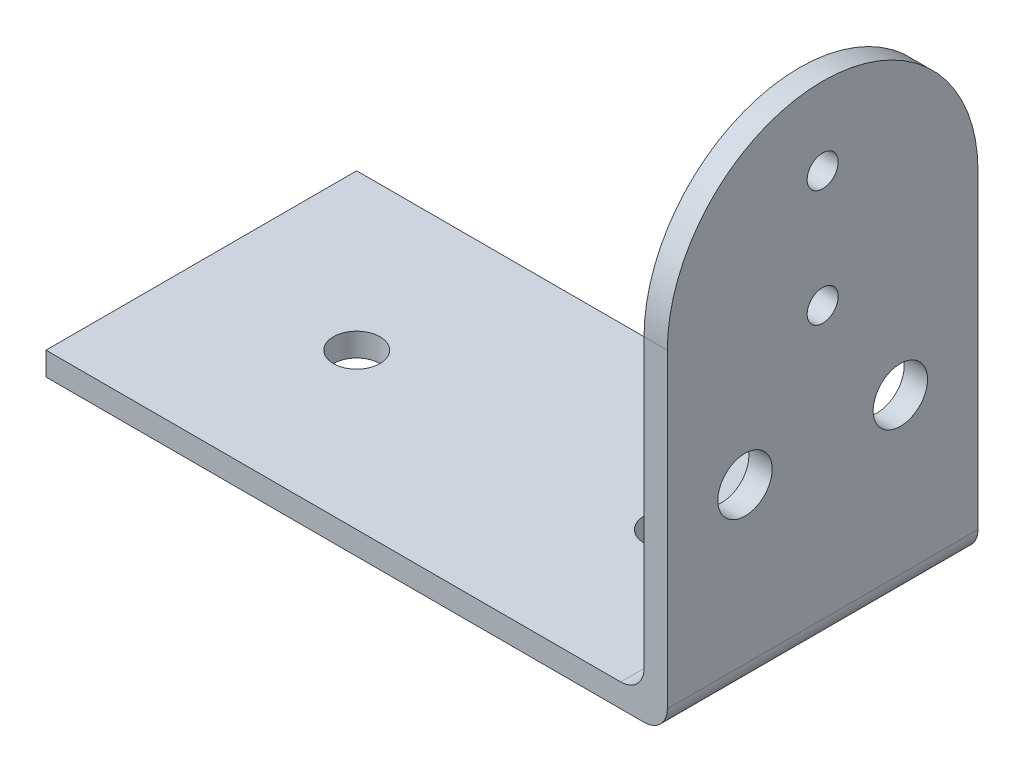
ISO-10303-21;
HEADER;
FILE_DESCRIPTION(('STEP AP214'),'2;1');
FILE_NAME('part.step','',(''),(''),'','','');
FILE_SCHEMA(('AUTOMOTIVE_DESIGN { 1 0 10303 214 1 1 1 1 }'));
ENDSEC;
DATA;
#1=APPLICATION_CONTEXT('core data for automotive mechanical design processes');
#2=APPLICATION_PROTOCOL_DEFINITION('international standard','automotive_design',2000,#1);
#3=PRODUCT_CONTEXT('',#1,'mechanical');
#4=PRODUCT('Part','Part','',(#3));
#5=PRODUCT_RELATED_PRODUCT_CATEGORY('part','',(#4));
#6=PRODUCT_DEFINITION_FORMATION('','',#4);
#7=PRODUCT_DEFINITION_CONTEXT('part definition',#1,'design');
#8=PRODUCT_DEFINITION('design','',#6,#7);
#9=PRODUCT_DEFINITION_SHAPE('','',#8);
#10=(LENGTH_UNIT() NAMED_UNIT(*) SI_UNIT(.MILLI.,.METRE.));
#11=(NAMED_UNIT(*) PLANE_ANGLE_UNIT() SI_UNIT($,.RADIAN.));
#12=(NAMED_UNIT(*) SI_UNIT($,.STERADIAN.) SOLID_ANGLE_UNIT());
#13=UNCERTAINTY_MEASURE_WITH_UNIT(LENGTH_MEASURE(1.E-05),#10,'distance_accuracy_value','');
#14=(GEOMETRIC_REPRESENTATION_CONTEXT(3) GLOBAL_UNCERTAINTY_ASSIGNED_CONTEXT((#13)) GLOBAL_UNIT_ASSIGNED_CONTEXT((#10,
#11,#12)) REPRESENTATION_CONTEXT('',''));
#15=CARTESIAN_POINT('',(0.,0.,0.));
#16=DIRECTION('',(0.,0.,1.));
#17=DIRECTION('',(1.,0.,0.));
#18=AXIS2_PLACEMENT_3D('',#15,#16,#17);
#19=CARTESIAN_POINT('',(80.,-3.,0.));
#20=DIRECTION('',(1.,0.,0.));
#21=DIRECTION('',(0.,0.,-1.));
#22=AXIS2_PLACEMENT_3D('',#19,#20,#21);
#23=PLANE('',#22);
#24=CARTESIAN_POINT('',(80.,50.,-20.));
#25=DIRECTION('',(1.,0.,0.));
#26=DIRECTION('',(0.,0.,-1.));
#27=AXIS2_PLACEMENT_3D('',#24,#25,#26);
#28=CIRCLE('',#27,2.);
#29=CARTESIAN_POINT('',(80.,50.,-22.));
#30=VERTEX_POINT('',#29);
#31=EDGE_CURVE('E241',#30,#30,#28,.T.);
#32=ORIENTED_EDGE('',*,*,#31,.F.);
#33=EDGE_LOOP('',(#32));
#34=FACE_BOUND('',#33,.T.);
#35=CARTESIAN_POINT('',(80.,35.,-20.));
#36=DIRECTION('',(1.,0.,0.));
#37=DIRECTION('',(0.,0.,-1.));
#38=AXIS2_PLACEMENT_3D('',#35,#36,#37);
#39=CIRCLE('',#38,2.);
#40=CARTESIAN_POINT('',(80.,35.,-22.));
#41=VERTEX_POINT('',#40);
#42=EDGE_CURVE('E238',#41,#41,#39,.T.);
#43=ORIENTED_EDGE('',*,*,#42,.F.);
#44=EDGE_LOOP('',(#43));
#45=FACE_BOUND('',#44,.T.);
#46=CARTESIAN_POINT('',(80.,20.,-9.99999999999999));
#47=DIRECTION('',(1.,0.,0.));
#48=DIRECTION('',(0.,0.,-1.));
#49=AXIS2_PLACEMENT_3D('',#46,#47,#48);
#50=CIRCLE('',#49,3.5);
#51=CARTESIAN_POINT('',(80.,20.,-13.5));
#52=VERTEX_POINT('',#51);
#53=EDGE_CURVE('E237',#52,#52,#50,.T.);
#54=ORIENTED_EDGE('',*,*,#53,.F.);
#55=EDGE_LOOP('',(#54));
#56=FACE_BOUND('',#55,.T.);
#57=CARTESIAN_POINT('',(80.,20.,-30.));
#58=DIRECTION('',(1.,0.,0.));
#59=DIRECTION('',(0.,0.,-1.));
#60=AXIS2_PLACEMENT_3D('',#57,#58,#59);
#61=CIRCLE('',#60,3.5);
#62=CARTESIAN_POINT('',(80.,20.,-33.5));
#63=VERTEX_POINT('',#62);
#64=EDGE_CURVE('E233',#63,#63,#61,.F.);
#65=ORIENTED_EDGE('',*,*,#64,.T.);
#66=EDGE_LOOP('',(#65));
#67=FACE_BOUND('',#66,.T.);
#68=DIRECTION('',(0.,1.,0.));
#69=VECTOR('',#68,1.);
#70=CARTESIAN_POINT('',(80.,-3.,-40.));
#71=LINE('',#70,#69);
#72=CARTESIAN_POINT('',(80.,0.,-40.));
#73=VERTEX_POINT('',#72);
#74=CARTESIAN_POINT('',(80.,40.,-40.));
#75=VERTEX_POINT('',#74);
#76=EDGE_CURVE('E155',#73,#75,#71,.T.);
#77=ORIENTED_EDGE('',*,*,#76,.T.);
#78=CARTESIAN_POINT('',(80.,40.,-20.));
#79=DIRECTION('',(1.,0.,0.));
#80=DIRECTION('',(0.,0.,-1.));
#81=AXIS2_PLACEMENT_3D('',#78,#79,#80);
#82=CIRCLE('',#81,20.);
#83=CARTESIAN_POINT('',(80.,40.,0.));
#84=VERTEX_POINT('',#83);
#85=EDGE_CURVE('E142',#75,#84,#82,.T.);
#86=ORIENTED_EDGE('',*,*,#85,.T.);
#87=DIRECTION('',(0.,1.,0.));
#88=VECTOR('',#87,1.);
#89=CARTESIAN_POINT('',(80.,-3.,0.));
#90=LINE('',#89,#88);
#91=CARTESIAN_POINT('',(80.,0.,0.));
#92=VERTEX_POINT('',#91);
#93=EDGE_CURVE('E163',#92,#84,#90,.T.);
#94=ORIENTED_EDGE('',*,*,#93,.F.);
#95=DIRECTION('',(0.,0.,-1.));
#96=VECTOR('',#95,1.);
#97=CARTESIAN_POINT('',(80.,0.,-40.));
#98=LINE('',#97,#96);
#99=EDGE_CURVE('E160',#92,#73,#98,.T.);
#100=ORIENTED_EDGE('',*,*,#99,.T.);
#101=EDGE_LOOP('',(#77,#86,#94,#100));
#102=FACE_BOUND('',#101,.T.);
#103=ADVANCED_FACE('F74',(#34,#45,#56,#67,#102),#23,.T.);
#104=CARTESIAN_POINT('',(77.,60.,0.));
#105=DIRECTION('',(1.,0.,0.));
#106=DIRECTION('',(0.,0.,-1.));
#107=AXIS2_PLACEMENT_3D('',#104,#105,#106);
#108=PLANE('',#107);
#109=CARTESIAN_POINT('',(77.,35.,-20.));
#110=DIRECTION('',(1.,0.,0.));
#111=DIRECTION('',(0.,0.,-1.));
#112=AXIS2_PLACEMENT_3D('',#109,#110,#111);
#113=CIRCLE('',#112,2.);
#114=CARTESIAN_POINT('',(77.,35.,-22.));
#115=VERTEX_POINT('',#114);
#116=EDGE_CURVE('E206',#115,#115,#113,.T.);
#117=ORIENTED_EDGE('',*,*,#116,.T.);
#118=EDGE_LOOP('',(#117));
#119=FACE_BOUND('',#118,.T.);
#120=CARTESIAN_POINT('',(77.,20.,-9.99999999999999));
#121=DIRECTION('',(1.,0.,0.));
#122=DIRECTION('',(0.,0.,-1.));
#123=AXIS2_PLACEMENT_3D('',#120,#121,#122);
#124=CIRCLE('',#123,3.5);
#125=CARTESIAN_POINT('',(77.,20.,-13.5));
#126=VERTEX_POINT('',#125);
#127=EDGE_CURVE('E197',#126,#126,#124,.T.);
#128=ORIENTED_EDGE('',*,*,#127,.T.);
#129=EDGE_LOOP('',(#128));
#130=FACE_BOUND('',#129,.T.);
#131=CARTESIAN_POINT('',(77.,20.,-30.));
#132=DIRECTION('',(1.,0.,0.));
#133=DIRECTION('',(0.,0.,-1.));
#134=AXIS2_PLACEMENT_3D('',#131,#132,#133);
#135=CIRCLE('',#134,3.5);
#136=CARTESIAN_POINT('',(77.,20.,-33.5));
#137=VERTEX_POINT('',#136);
#138=EDGE_CURVE('E201',#137,#137,#135,.F.);
#139=ORIENTED_EDGE('',*,*,#138,.F.);
#140=EDGE_LOOP('',(#139));
#141=FACE_BOUND('',#140,.T.);
#142=CARTESIAN_POINT('',(77.,50.,-20.));
#143=DIRECTION('',(1.,0.,0.));
#144=DIRECTION('',(0.,0.,-1.));
#145=AXIS2_PLACEMENT_3D('',#142,#143,#144);
#146=CIRCLE('',#145,2.);
#147=CARTESIAN_POINT('',(77.,50.,-22.));
#148=VERTEX_POINT('',#147);
#149=EDGE_CURVE('E210',#148,#148,#146,.T.);
#150=ORIENTED_EDGE('',*,*,#149,.T.);
#151=EDGE_LOOP('',(#150));
#152=FACE_BOUND('',#151,.T.);
#153=CARTESIAN_POINT('',(77.,40.,-20.));
#154=DIRECTION('',(1.,0.,0.));
#155=DIRECTION('',(0.,0.,-1.));
#156=AXIS2_PLACEMENT_3D('',#153,#154,#155);
#157=CIRCLE('',#156,20.);
#158=CARTESIAN_POINT('',(77.,40.,-40.));
#159=VERTEX_POINT('',#158);
#160=CARTESIAN_POINT('',(77.,40.,0.));
#161=VERTEX_POINT('',#160);
#162=EDGE_CURVE('E202',#159,#161,#157,.T.);
#163=ORIENTED_EDGE('',*,*,#162,.F.);
#164=DIRECTION('',(0.,-1.,0.));
#165=VECTOR('',#164,1.);
#166=CARTESIAN_POINT('',(77.,60.,-40.));
#167=LINE('',#166,#165);
#168=CARTESIAN_POINT('',(77.,3.,-40.));
#169=VERTEX_POINT('',#168);
#170=EDGE_CURVE('E157',#159,#169,#167,.T.);
#171=ORIENTED_EDGE('',*,*,#170,.T.);
#172=DIRECTION('',(0.,0.,1.));
#173=VECTOR('',#172,1.);
#174=CARTESIAN_POINT('',(77.,3.,0.));
#175=LINE('',#174,#173);
#176=CARTESIAN_POINT('',(77.,3.,0.));
#177=VERTEX_POINT('',#176);
#178=EDGE_CURVE('E186',#169,#177,#175,.T.);
#179=ORIENTED_EDGE('',*,*,#178,.T.);
#180=DIRECTION('',(0.,-1.,0.));
#181=VECTOR('',#180,1.);
#182=CARTESIAN_POINT('',(77.,60.,0.));
#183=LINE('',#182,#181);
#184=EDGE_CURVE('E92',#161,#177,#183,.T.);
#185=ORIENTED_EDGE('',*,*,#184,.F.);
#186=EDGE_LOOP('',(#163,#171,#179,#185));
#187=FACE_BOUND('',#186,.T.);
#188=ADVANCED_FACE('F290',(#119,#130,#141,#152,#187),#108,.F.);
#189=CARTESIAN_POINT('',(0.,-3.,0.));
#190=DIRECTION('',(0.,0.,1.));
#191=DIRECTION('',(1.,0.,0.));
#192=AXIS2_PLACEMENT_3D('',#189,#190,#191);
#193=PLANE('',#192);
#194=DIRECTION('',(1.,0.,0.));
#195=VECTOR('',#194,1.);
#196=CARTESIAN_POINT('',(0.,40.,0.));
#197=LINE('',#196,#195);
#198=EDGE_CURVE('E145',#161,#84,#197,.T.);
#199=ORIENTED_EDGE('',*,*,#198,.F.);
#200=ORIENTED_EDGE('',*,*,#184,.T.);
#201=CARTESIAN_POINT('',(74.,3.,0.));
#202=DIRECTION('',(0.,0.,1.));
#203=DIRECTION('',(1.,0.,0.));
#204=AXIS2_PLACEMENT_3D('',#201,#202,#203);
#205=CIRCLE('',#204,3.);
#206=CARTESIAN_POINT('',(74.,0.,0.));
#207=VERTEX_POINT('',#206);
#208=EDGE_CURVE('E96',#177,#207,#205,.F.);
#209=ORIENTED_EDGE('',*,*,#208,.T.);
#210=DIRECTION('',(1.,0.,0.));
#211=VECTOR('',#210,1.);
#212=CARTESIAN_POINT('',(0.,0.,0.));
#213=LINE('',#212,#211);
#214=CARTESIAN_POINT('',(0.,0.,0.));
#215=VERTEX_POINT('',#214);
#216=EDGE_CURVE('E257',#215,#207,#213,.T.);
#217=ORIENTED_EDGE('',*,*,#216,.F.);
#218=DIRECTION('',(0.,1.,0.));
#219=VECTOR('',#218,1.);
#220=CARTESIAN_POINT('',(0.,-3.,0.));
#221=LINE('',#220,#219);
#222=CARTESIAN_POINT('',(0.,-3.,0.));
#223=VERTEX_POINT('',#222);
#224=EDGE_CURVE('E169',#223,#215,#221,.T.);
#225=ORIENTED_EDGE('',*,*,#224,.F.);
#226=DIRECTION('',(1.,0.,0.));
#227=VECTOR('',#226,1.);
#228=CARTESIAN_POINT('',(0.,-3.,0.));
#229=LINE('',#228,#227);
#230=CARTESIAN_POINT('',(77.,-3.,0.));
#231=VERTEX_POINT('',#230);
#232=EDGE_CURVE('E258',#223,#231,#229,.T.);
#233=ORIENTED_EDGE('',*,*,#232,.T.);
#234=CARTESIAN_POINT('',(77.,0.,0.));
#235=DIRECTION('',(0.,0.,1.));
#236=DIRECTION('',(1.,0.,0.));
#237=AXIS2_PLACEMENT_3D('',#234,#235,#236);
#238=CIRCLE('',#237,3.);
#239=EDGE_CURVE('E183',#231,#92,#238,.T.);
#240=ORIENTED_EDGE('',*,*,#239,.T.);
#241=ORIENTED_EDGE('',*,*,#93,.T.);
#242=EDGE_LOOP('',(#199,#200,#209,#217,#225,#233,#240,#241));
#243=FACE_BOUND('',#242,.T.);
#244=ADVANCED_FACE('F288',(#243),#193,.T.);
#245=CARTESIAN_POINT('',(0.,-3.,0.));
#246=DIRECTION('',(1.,0.,0.));
#247=DIRECTION('',(0.,0.,-1.));
#248=AXIS2_PLACEMENT_3D('',#245,#246,#247);
#249=PLANE('',#248);
#250=DIRECTION('',(0.,0.,-1.));
#251=VECTOR('',#250,1.);
#252=CARTESIAN_POINT('',(0.,0.,0.));
#253=LINE('',#252,#251);
#254=CARTESIAN_POINT('',(0.,0.,-40.));
#255=VERTEX_POINT('',#254);
#256=EDGE_CURVE('E263',#215,#255,#253,.T.);
#257=ORIENTED_EDGE('',*,*,#256,.T.);
#258=DIRECTION('',(0.,1.,0.));
#259=VECTOR('',#258,1.);
#260=CARTESIAN_POINT('',(0.,-3.,-40.));
#261=LINE('',#260,#259);
#262=CARTESIAN_POINT('',(0.,-3.,-40.));
#263=VERTEX_POINT('',#262);
#264=EDGE_CURVE('E162',#263,#255,#261,.T.);
#265=ORIENTED_EDGE('',*,*,#264,.F.);
#266=DIRECTION('',(0.,0.,-1.));
#267=VECTOR('',#266,1.);
#268=CARTESIAN_POINT('',(0.,-3.,0.));
#269=LINE('',#268,#267);
#270=EDGE_CURVE('E171',#223,#263,#269,.T.);
#271=ORIENTED_EDGE('',*,*,#270,.F.);
#272=ORIENTED_EDGE('',*,*,#224,.T.);
#273=EDGE_LOOP('',(#257,#265,#271,#272));
#274=FACE_BOUND('',#273,.T.);
#275=ADVANCED_FACE('F281',(#274),#249,.F.);
#276=CARTESIAN_POINT('',(0.,-3.,-40.));
#277=DIRECTION('',(0.,0.,1.));
#278=DIRECTION('',(1.,0.,0.));
#279=AXIS2_PLACEMENT_3D('',#276,#277,#278);
#280=PLANE('',#279);
#281=ORIENTED_EDGE('',*,*,#170,.F.);
#282=DIRECTION('',(1.,0.,0.));
#283=VECTOR('',#282,1.);
#284=CARTESIAN_POINT('',(0.,40.,-40.));
#285=LINE('',#284,#283);
#286=EDGE_CURVE('E12',#159,#75,#285,.T.);
#287=ORIENTED_EDGE('',*,*,#286,.T.);
#288=ORIENTED_EDGE('',*,*,#76,.F.);
#289=CARTESIAN_POINT('',(77.,0.,-40.));
#290=DIRECTION('',(0.,0.,1.));
#291=DIRECTION('',(1.,0.,0.));
#292=AXIS2_PLACEMENT_3D('',#289,#290,#291);
#293=CIRCLE('',#292,3.);
#294=CARTESIAN_POINT('',(77.,-3.,-40.));
#295=VERTEX_POINT('',#294);
#296=EDGE_CURVE('E177',#73,#295,#293,.F.);
#297=ORIENTED_EDGE('',*,*,#296,.T.);
#298=DIRECTION('',(1.,0.,0.));
#299=VECTOR('',#298,1.);
#300=CARTESIAN_POINT('',(0.,-3.,-40.));
#301=LINE('',#300,#299);
#302=EDGE_CURVE('E262',#263,#295,#301,.T.);
#303=ORIENTED_EDGE('',*,*,#302,.F.);
#304=ORIENTED_EDGE('',*,*,#264,.T.);
#305=DIRECTION('',(1.,0.,0.));
#306=VECTOR('',#305,1.);
#307=CARTESIAN_POINT('',(0.,0.,-40.));
#308=LINE('',#307,#306);
#309=CARTESIAN_POINT('',(74.,0.,-40.));
#310=VERTEX_POINT('',#309);
#311=EDGE_CURVE('E271',#255,#310,#308,.T.);
#312=ORIENTED_EDGE('',*,*,#311,.T.);
#313=CARTESIAN_POINT('',(74.,3.,-40.));
#314=DIRECTION('',(0.,0.,1.));
#315=DIRECTION('',(1.,0.,0.));
#316=AXIS2_PLACEMENT_3D('',#313,#314,#315);
#317=CIRCLE('',#316,3.);
#318=EDGE_CURVE('E84',#310,#169,#317,.T.);
#319=ORIENTED_EDGE('',*,*,#318,.T.);
#320=EDGE_LOOP('',(#281,#287,#288,#297,#303,#304,#312,#319));
#321=FACE_BOUND('',#320,.T.);
#322=ADVANCED_FACE('F154',(#321),#280,.F.);
#323=CARTESIAN_POINT('',(0.,-3.,0.));
#324=DIRECTION('',(0.,1.,0.));
#325=DIRECTION('',(0.,0.,1.));
#326=AXIS2_PLACEMENT_3D('',#323,#324,#325);
#327=PLANE('',#326);
#328=CARTESIAN_POINT('',(20.,-3.,-20.));
#329=DIRECTION('',(0.,-1.,0.));
#330=DIRECTION('',(0.,0.,-1.));
#331=AXIS2_PLACEMENT_3D('',#328,#329,#330);
#332=CIRCLE('',#331,3.);
#333=CARTESIAN_POINT('',(20.,-3.,-23.));
#334=VERTEX_POINT('',#333);
#335=EDGE_CURVE('E216',#334,#334,#332,.T.);
#336=ORIENTED_EDGE('',*,*,#335,.F.);
#337=EDGE_LOOP('',(#336));
#338=FACE_BOUND('',#337,.T.);
#339=CARTESIAN_POINT('',(60.,-3.,-20.));
#340=DIRECTION('',(0.,-1.,0.));
#341=DIRECTION('',(0.,0.,-1.));
#342=AXIS2_PLACEMENT_3D('',#339,#340,#341);
#343=CIRCLE('',#342,3.00000000000001);
#344=CARTESIAN_POINT('',(60.,-3.,-23.));
#345=VERTEX_POINT('',#344);
#346=EDGE_CURVE('E224',#345,#345,#343,.T.);
#347=ORIENTED_EDGE('',*,*,#346,.F.);
#348=EDGE_LOOP('',(#347));
#349=FACE_BOUND('',#348,.T.);
#350=ORIENTED_EDGE('',*,*,#302,.T.);
#351=DIRECTION('',(0.,0.,-1.));
#352=VECTOR('',#351,1.);
#353=CARTESIAN_POINT('',(77.,-3.,0.));
#354=LINE('',#353,#352);
#355=EDGE_CURVE('E180',#295,#231,#354,.F.);
#356=ORIENTED_EDGE('',*,*,#355,.T.);
#357=ORIENTED_EDGE('',*,*,#232,.F.);
#358=ORIENTED_EDGE('',*,*,#270,.T.);
#359=EDGE_LOOP('',(#350,#356,#357,#358));
#360=FACE_BOUND('',#359,.T.);
#361=ADVANCED_FACE('F309',(#338,#349,#360),#327,.F.);
#362=CARTESIAN_POINT('',(0.,0.,0.));
#363=DIRECTION('',(0.,1.,0.));
#364=DIRECTION('',(0.,0.,1.));
#365=AXIS2_PLACEMENT_3D('',#362,#363,#364);
#366=PLANE('',#365);
#367=CARTESIAN_POINT('',(20.,0.,-20.));
#368=DIRECTION('',(0.,1.,0.));
#369=DIRECTION('',(0.,0.,1.));
#370=AXIS2_PLACEMENT_3D('',#367,#368,#369);
#371=CIRCLE('',#370,3.);
#372=CARTESIAN_POINT('',(20.,0.,-17.));
#373=VERTEX_POINT('',#372);
#374=EDGE_CURVE('E78',#373,#373,#371,.T.);
#375=ORIENTED_EDGE('',*,*,#374,.F.);
#376=EDGE_LOOP('',(#375));
#377=FACE_BOUND('',#376,.T.);
#378=CARTESIAN_POINT('',(60.,0.,-20.));
#379=DIRECTION('',(0.,1.,0.));
#380=DIRECTION('',(0.,0.,1.));
#381=AXIS2_PLACEMENT_3D('',#378,#379,#380);
#382=CIRCLE('',#381,3.00000000000001);
#383=CARTESIAN_POINT('',(60.,0.,-17.));
#384=VERTEX_POINT('',#383);
#385=EDGE_CURVE('E213',#384,#384,#382,.T.);
#386=ORIENTED_EDGE('',*,*,#385,.F.);
#387=EDGE_LOOP('',(#386));
#388=FACE_BOUND('',#387,.T.);
#389=ORIENTED_EDGE('',*,*,#216,.T.);
#390=DIRECTION('',(0.,0.,1.));
#391=VECTOR('',#390,1.);
#392=CARTESIAN_POINT('',(74.,0.,0.));
#393=LINE('',#392,#391);
#394=EDGE_CURVE('E190',#207,#310,#393,.F.);
#395=ORIENTED_EDGE('',*,*,#394,.T.);
#396=ORIENTED_EDGE('',*,*,#311,.F.);
#397=ORIENTED_EDGE('',*,*,#256,.F.);
#398=EDGE_LOOP('',(#389,#395,#396,#397));
#399=FACE_BOUND('',#398,.T.);
#400=ADVANCED_FACE('F286',(#377,#388,#399),#366,.T.);
#401=CARTESIAN_POINT('',(77.,0.,0.));
#402=DIRECTION('',(0.,0.,1.));
#403=DIRECTION('',(1.,0.,0.));
#404=AXIS2_PLACEMENT_3D('',#401,#402,#403);
#405=CYLINDRICAL_SURFACE('',#404,3.);
#406=ORIENTED_EDGE('',*,*,#239,.F.);
#407=ORIENTED_EDGE('',*,*,#355,.F.);
#408=ORIENTED_EDGE('',*,*,#296,.F.);
#409=ORIENTED_EDGE('',*,*,#99,.F.);
#410=EDGE_LOOP('',(#406,#407,#408,#409));
#411=FACE_BOUND('',#410,.T.);
#412=ADVANCED_FACE('F313',(#411),#405,.T.);
#413=CARTESIAN_POINT('',(74.,3.,0.));
#414=DIRECTION('',(0.,0.,1.));
#415=DIRECTION('',(1.,0.,0.));
#416=AXIS2_PLACEMENT_3D('',#413,#414,#415);
#417=CYLINDRICAL_SURFACE('',#416,3.);
#418=ORIENTED_EDGE('',*,*,#318,.F.);
#419=ORIENTED_EDGE('',*,*,#394,.F.);
#420=ORIENTED_EDGE('',*,*,#208,.F.);
#421=ORIENTED_EDGE('',*,*,#178,.F.);
#422=EDGE_LOOP('',(#418,#419,#420,#421));
#423=FACE_BOUND('',#422,.T.);
#424=ADVANCED_FACE('F76',(#423),#417,.F.);
#425=CARTESIAN_POINT('',(0.,40.,-20.));
#426=DIRECTION('',(1.,0.,0.));
#427=DIRECTION('',(0.,0.,-1.));
#428=AXIS2_PLACEMENT_3D('',#425,#426,#427);
#429=CYLINDRICAL_SURFACE('',#428,20.);
#430=ORIENTED_EDGE('',*,*,#162,.T.);
#431=ORIENTED_EDGE('',*,*,#198,.T.);
#432=ORIENTED_EDGE('',*,*,#85,.F.);
#433=ORIENTED_EDGE('',*,*,#286,.F.);
#434=EDGE_LOOP('',(#430,#431,#432,#433));
#435=FACE_BOUND('',#434,.T.);
#436=ADVANCED_FACE('F143',(#435),#429,.T.);
#437=CARTESIAN_POINT('',(0.,20.,-9.99999999999999));
#438=DIRECTION('',(1.,0.,0.));
#439=DIRECTION('',(0.,0.,-1.));
#440=AXIS2_PLACEMENT_3D('',#437,#438,#439);
#441=CYLINDRICAL_SURFACE('',#440,3.5);
#442=ORIENTED_EDGE('',*,*,#53,.T.);
#443=EDGE_LOOP('',(#442));
#444=FACE_BOUND('',#443,.T.);
#445=ORIENTED_EDGE('',*,*,#127,.F.);
#446=EDGE_LOOP('',(#445));
#447=FACE_BOUND('',#446,.T.);
#448=ADVANCED_FACE('F318',(#444,#447),#441,.F.);
#449=CARTESIAN_POINT('',(0.,20.,-30.));
#450=DIRECTION('',(1.,0.,0.));
#451=DIRECTION('',(0.,0.,-1.));
#452=AXIS2_PLACEMENT_3D('',#449,#450,#451);
#453=CYLINDRICAL_SURFACE('',#452,3.5);
#454=ORIENTED_EDGE('',*,*,#64,.F.);
#455=EDGE_LOOP('',(#454));
#456=FACE_BOUND('',#455,.T.);
#457=ORIENTED_EDGE('',*,*,#138,.T.);
#458=EDGE_LOOP('',(#457));
#459=FACE_BOUND('',#458,.T.);
#460=ADVANCED_FACE('F321',(#456,#459),#453,.F.);
#461=CARTESIAN_POINT('',(0.,35.,-20.));
#462=DIRECTION('',(1.,0.,0.));
#463=DIRECTION('',(0.,0.,-1.));
#464=AXIS2_PLACEMENT_3D('',#461,#462,#463);
#465=CYLINDRICAL_SURFACE('',#464,2.);
#466=ORIENTED_EDGE('',*,*,#42,.T.);
#467=EDGE_LOOP('',(#466));
#468=FACE_BOUND('',#467,.T.);
#469=ORIENTED_EDGE('',*,*,#116,.F.);
#470=EDGE_LOOP('',(#469));
#471=FACE_BOUND('',#470,.T.);
#472=ADVANCED_FACE('F327',(#468,#471),#465,.F.);
#473=CARTESIAN_POINT('',(0.,50.,-20.));
#474=DIRECTION('',(1.,0.,0.));
#475=DIRECTION('',(0.,0.,-1.));
#476=AXIS2_PLACEMENT_3D('',#473,#474,#475);
#477=CYLINDRICAL_SURFACE('',#476,2.);
#478=ORIENTED_EDGE('',*,*,#31,.T.);
#479=EDGE_LOOP('',(#478));
#480=FACE_BOUND('',#479,.T.);
#481=ORIENTED_EDGE('',*,*,#149,.F.);
#482=EDGE_LOOP('',(#481));
#483=FACE_BOUND('',#482,.T.);
#484=ADVANCED_FACE('F323',(#480,#483),#477,.F.);
#485=CARTESIAN_POINT('',(60.,60.,-20.));
#486=DIRECTION('',(0.,-1.,0.));
#487=DIRECTION('',(0.,0.,-1.));
#488=AXIS2_PLACEMENT_3D('',#485,#486,#487);
#489=CYLINDRICAL_SURFACE('',#488,3.00000000000001);
#490=ORIENTED_EDGE('',*,*,#385,.T.);
#491=EDGE_LOOP('',(#490));
#492=FACE_BOUND('',#491,.T.);
#493=ORIENTED_EDGE('',*,*,#346,.T.);
#494=EDGE_LOOP('',(#493));
#495=FACE_BOUND('',#494,.T.);
#496=ADVANCED_FACE('F326',(#492,#495),#489,.F.);
#497=CARTESIAN_POINT('',(20.,60.,-20.));
#498=DIRECTION('',(0.,-1.,0.));
#499=DIRECTION('',(0.,0.,-1.));
#500=AXIS2_PLACEMENT_3D('',#497,#498,#499);
#501=CYLINDRICAL_SURFACE('',#500,3.);
#502=ORIENTED_EDGE('',*,*,#374,.T.);
#503=EDGE_LOOP('',(#502));
#504=FACE_BOUND('',#503,.T.);
#505=ORIENTED_EDGE('',*,*,#335,.T.);
#506=EDGE_LOOP('',(#505));
#507=FACE_BOUND('',#506,.T.);
#508=ADVANCED_FACE('F339',(#504,#507),#501,.F.);
#509=CLOSED_SHELL('',(#103,#188,#244,#275,#322,#361,#400,#412,#424,#436,#448,#460,#472,#484,
#496,#508));
#510=MANIFOLD_SOLID_BREP('B2',#509);
#511=ADVANCED_BREP_SHAPE_REPRESENTATION('',(#18,#510),#14);
#512=SHAPE_DEFINITION_REPRESENTATION(#9,#511);
ENDSEC;
END-ISO-10303-21;
